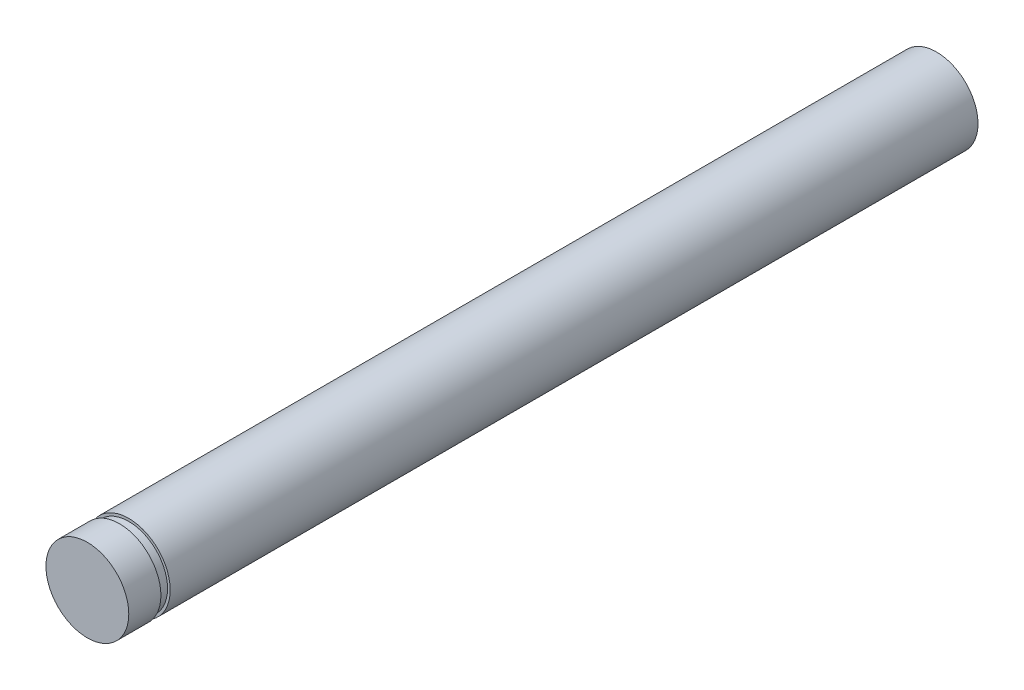
ISO-10303-21;
HEADER;
FILE_DESCRIPTION(('STEP AP214'),'2;1');
FILE_NAME('part.step','',(''),(''),'','','');
FILE_SCHEMA(('AUTOMOTIVE_DESIGN { 1 0 10303 214 1 1 1 1 }'));
ENDSEC;
DATA;
#1=APPLICATION_CONTEXT('core data for automotive mechanical design processes');
#2=APPLICATION_PROTOCOL_DEFINITION('international standard','automotive_design',2000,#1);
#3=PRODUCT_CONTEXT('',#1,'mechanical');
#4=PRODUCT('Part','Part','',(#3));
#5=PRODUCT_RELATED_PRODUCT_CATEGORY('part','',(#4));
#6=PRODUCT_DEFINITION_FORMATION('','',#4);
#7=PRODUCT_DEFINITION_CONTEXT('part definition',#1,'design');
#8=PRODUCT_DEFINITION('design','',#6,#7);
#9=PRODUCT_DEFINITION_SHAPE('','',#8);
#10=(LENGTH_UNIT() NAMED_UNIT(*) SI_UNIT(.MILLI.,.METRE.));
#11=(NAMED_UNIT(*) PLANE_ANGLE_UNIT() SI_UNIT($,.RADIAN.));
#12=(NAMED_UNIT(*) SI_UNIT($,.STERADIAN.) SOLID_ANGLE_UNIT());
#13=UNCERTAINTY_MEASURE_WITH_UNIT(LENGTH_MEASURE(1.E-05),#10,'distance_accuracy_value','');
#14=(GEOMETRIC_REPRESENTATION_CONTEXT(3) GLOBAL_UNCERTAINTY_ASSIGNED_CONTEXT((#13)) GLOBAL_UNIT_ASSIGNED_CONTEXT((#10,
#11,#12)) REPRESENTATION_CONTEXT('',''));
#15=CARTESIAN_POINT('',(0.,0.,0.));
#16=DIRECTION('',(0.,0.,1.));
#17=DIRECTION('',(1.,0.,0.));
#18=AXIS2_PLACEMENT_3D('',#15,#16,#17);
#19=CARTESIAN_POINT('',(0.,0.,6.35));
#20=DIRECTION('',(0.,0.,-1.));
#21=DIRECTION('',(-1.,0.,0.));
#22=AXIS2_PLACEMENT_3D('',#19,#20,#21);
#23=CYLINDRICAL_SURFACE('',#22,6.34999999999994);
#24=CARTESIAN_POINT('',(0.,0.,1.4224));
#25=DIRECTION('',(0.,0.,1.));
#26=DIRECTION('',(1.,0.,0.));
#27=AXIS2_PLACEMENT_3D('',#24,#25,#26);
#28=CIRCLE('',#27,6.34999999999994);
#29=CARTESIAN_POINT('',(6.34999999999994,0.,1.4224));
#30=VERTEX_POINT('',#29);
#31=EDGE_CURVE('E72',#30,#30,#28,.T.);
#32=ORIENTED_EDGE('',*,*,#31,.T.);
#33=EDGE_LOOP('',(#32));
#34=FACE_BOUND('',#33,.T.);
#35=CARTESIAN_POINT('',(0.,0.,6.35));
#36=DIRECTION('',(0.,0.,1.));
#37=DIRECTION('',(1.,0.,0.));
#38=AXIS2_PLACEMENT_3D('',#35,#36,#37);
#39=CIRCLE('',#38,6.34999999999994);
#40=CARTESIAN_POINT('',(6.34999999999994,0.,6.35));
#41=VERTEX_POINT('',#40);
#42=EDGE_CURVE('E11',#41,#41,#39,.T.);
#43=ORIENTED_EDGE('',*,*,#42,.F.);
#44=EDGE_LOOP('',(#43));
#45=FACE_BOUND('',#44,.T.);
#46=ADVANCED_FACE('F39',(#34,#45),#23,.T.);
#47=CARTESIAN_POINT('',(0.,0.,6.35));
#48=DIRECTION('',(0.,0.,1.));
#49=DIRECTION('',(1.,0.,0.));
#50=AXIS2_PLACEMENT_3D('',#47,#48,#49);
#51=PLANE('',#50);
#52=ORIENTED_EDGE('',*,*,#42,.T.);
#53=EDGE_LOOP('',(#52));
#54=FACE_BOUND('',#53,.T.);
#55=ADVANCED_FACE('F94',(#54),#51,.T.);
#56=CARTESIAN_POINT('',(0.,-5.9436,1.4224));
#57=DIRECTION('',(0.,0.,1.));
#58=DIRECTION('',(1.,0.,0.));
#59=AXIS2_PLACEMENT_3D('',#56,#57,#58);
#60=PLANE('',#59);
#61=ORIENTED_EDGE('',*,*,#31,.F.);
#62=EDGE_LOOP('',(#61));
#63=FACE_BOUND('',#62,.T.);
#64=CARTESIAN_POINT('',(0.,0.,1.4224));
#65=DIRECTION('',(0.,0.,1.));
#66=DIRECTION('',(1.,0.,0.));
#67=AXIS2_PLACEMENT_3D('',#64,#65,#66);
#68=CIRCLE('',#67,5.9436);
#69=CARTESIAN_POINT('',(5.9436,0.,1.4224));
#70=VERTEX_POINT('',#69);
#71=EDGE_CURVE('E58',#70,#70,#68,.T.);
#72=ORIENTED_EDGE('',*,*,#71,.T.);
#73=EDGE_LOOP('',(#72));
#74=FACE_BOUND('',#73,.T.);
#75=ADVANCED_FACE('F99',(#63,#74),#60,.F.);
#76=CARTESIAN_POINT('',(0.,-5.9436,0.));
#77=DIRECTION('',(0.,0.,-1.));
#78=DIRECTION('',(-1.,0.,0.));
#79=AXIS2_PLACEMENT_3D('',#76,#77,#78);
#80=PLANE('',#79);
#81=CARTESIAN_POINT('',(0.,0.,0.));
#82=DIRECTION('',(0.,0.,1.));
#83=DIRECTION('',(1.,0.,0.));
#84=AXIS2_PLACEMENT_3D('',#81,#82,#83);
#85=CIRCLE('',#84,5.9436);
#86=CARTESIAN_POINT('',(5.9436,0.,0.));
#87=VERTEX_POINT('',#86);
#88=EDGE_CURVE('E62',#87,#87,#85,.T.);
#89=ORIENTED_EDGE('',*,*,#88,.F.);
#90=EDGE_LOOP('',(#89));
#91=FACE_BOUND('',#90,.T.);
#92=CARTESIAN_POINT('',(0.,0.,0.));
#93=DIRECTION('',(0.,0.,1.));
#94=DIRECTION('',(1.,0.,0.));
#95=AXIS2_PLACEMENT_3D('',#92,#93,#94);
#96=CIRCLE('',#95,6.34999999999994);
#97=CARTESIAN_POINT('',(6.34999999999994,0.,0.));
#98=VERTEX_POINT('',#97);
#99=EDGE_CURVE('E69',#98,#98,#96,.T.);
#100=ORIENTED_EDGE('',*,*,#99,.T.);
#101=EDGE_LOOP('',(#100));
#102=FACE_BOUND('',#101,.T.);
#103=ADVANCED_FACE('F88',(#91,#102),#80,.F.);
#104=CARTESIAN_POINT('',(0.,0.,0.));
#105=DIRECTION('',(0.,0.,1.));
#106=DIRECTION('',(1.,0.,0.));
#107=AXIS2_PLACEMENT_3D('',#104,#105,#106);
#108=CYLINDRICAL_SURFACE('',#107,5.9436);
#109=ORIENTED_EDGE('',*,*,#71,.F.);
#110=EDGE_LOOP('',(#109));
#111=FACE_BOUND('',#110,.T.);
#112=ORIENTED_EDGE('',*,*,#88,.T.);
#113=EDGE_LOOP('',(#112));
#114=FACE_BOUND('',#113,.T.);
#115=ADVANCED_FACE('F80',(#111,#114),#108,.T.);
#116=CARTESIAN_POINT('',(0.,0.,-123.825));
#117=DIRECTION('',(0.,0.,1.));
#118=DIRECTION('',(1.,0.,0.));
#119=AXIS2_PLACEMENT_3D('',#116,#117,#118);
#120=PLANE('',#119);
#121=CARTESIAN_POINT('',(0.,0.,-123.825));
#122=DIRECTION('',(0.,0.,-1.));
#123=DIRECTION('',(-1.,0.,0.));
#124=AXIS2_PLACEMENT_3D('',#121,#122,#123);
#125=CIRCLE('',#124,2.55269999999999);
#126=CARTESIAN_POINT('',(-2.55269999999999,0.,-123.825));
#127=VERTEX_POINT('',#126);
#128=EDGE_CURVE('E59',#127,#127,#125,.T.);
#129=ORIENTED_EDGE('',*,*,#128,.F.);
#130=EDGE_LOOP('',(#129));
#131=FACE_BOUND('',#130,.T.);
#132=CARTESIAN_POINT('',(0.,0.,-123.825));
#133=DIRECTION('',(0.,0.,1.));
#134=DIRECTION('',(1.,0.,0.));
#135=AXIS2_PLACEMENT_3D('',#132,#133,#134);
#136=CIRCLE('',#135,6.34999999999994);
#137=CARTESIAN_POINT('',(6.34999999999994,0.,-123.825));
#138=VERTEX_POINT('',#137);
#139=EDGE_CURVE('E46',#138,#138,#136,.T.);
#140=ORIENTED_EDGE('',*,*,#139,.F.);
#141=EDGE_LOOP('',(#140));
#142=FACE_BOUND('',#141,.T.);
#143=ADVANCED_FACE('F78',(#131,#142),#120,.F.);
#144=ORIENTED_EDGE('',*,*,#99,.F.);
#145=EDGE_LOOP('',(#144));
#146=FACE_BOUND('',#145,.T.);
#147=ORIENTED_EDGE('',*,*,#139,.T.);
#148=EDGE_LOOP('',(#147));
#149=FACE_BOUND('',#148,.T.);
#150=ADVANCED_FACE('F41',(#146,#149),#23,.T.);
#151=CARTESIAN_POINT('',(0.,0.,-107.315));
#152=DIRECTION('',(0.,0.,-1.));
#153=DIRECTION('',(-1.,0.,0.));
#154=AXIS2_PLACEMENT_3D('',#151,#152,#153);
#155=CONICAL_SURFACE('',#154,2.5527,1.02974425867665);
#156=CARTESIAN_POINT('',(0.,0.,-105.781183097808));
#157=VERTEX_POINT('',#156);
#158=VERTEX_LOOP('',#157);
#159=FACE_BOUND('',#158,.T.);
#160=CARTESIAN_POINT('',(0.,0.,-107.315));
#161=DIRECTION('',(0.,0.,-1.));
#162=DIRECTION('',(-1.,0.,0.));
#163=AXIS2_PLACEMENT_3D('',#160,#161,#162);
#164=CIRCLE('',#163,2.5527);
#165=CARTESIAN_POINT('',(-2.5527,0.,-107.315));
#166=VERTEX_POINT('',#165);
#167=EDGE_CURVE('E56',#166,#166,#164,.T.);
#168=ORIENTED_EDGE('',*,*,#167,.T.);
#169=EDGE_LOOP('',(#168));
#170=FACE_BOUND('',#169,.T.);
#171=ADVANCED_FACE('F49',(#159,#170),#155,.F.);
#172=CARTESIAN_POINT('',(0.,0.,-123.825));
#173=DIRECTION('',(0.,0.,-1.));
#174=DIRECTION('',(-1.,0.,0.));
#175=AXIS2_PLACEMENT_3D('',#172,#173,#174);
#176=CYLINDRICAL_SURFACE('',#175,2.55269999999999);
#177=ORIENTED_EDGE('',*,*,#167,.F.);
#178=EDGE_LOOP('',(#177));
#179=FACE_BOUND('',#178,.T.);
#180=ORIENTED_EDGE('',*,*,#128,.T.);
#181=EDGE_LOOP('',(#180));
#182=FACE_BOUND('',#181,.T.);
#183=ADVANCED_FACE('F52',(#179,#182),#176,.F.);
#184=CLOSED_SHELL('',(#46,#55,#75,#103,#115,#143,#150,#171,#183));
#185=MANIFOLD_SOLID_BREP('B2',#184);
#186=ADVANCED_BREP_SHAPE_REPRESENTATION('',(#18,#185),#14);
#187=SHAPE_DEFINITION_REPRESENTATION(#9,#186);
ENDSEC;
END-ISO-10303-21;
